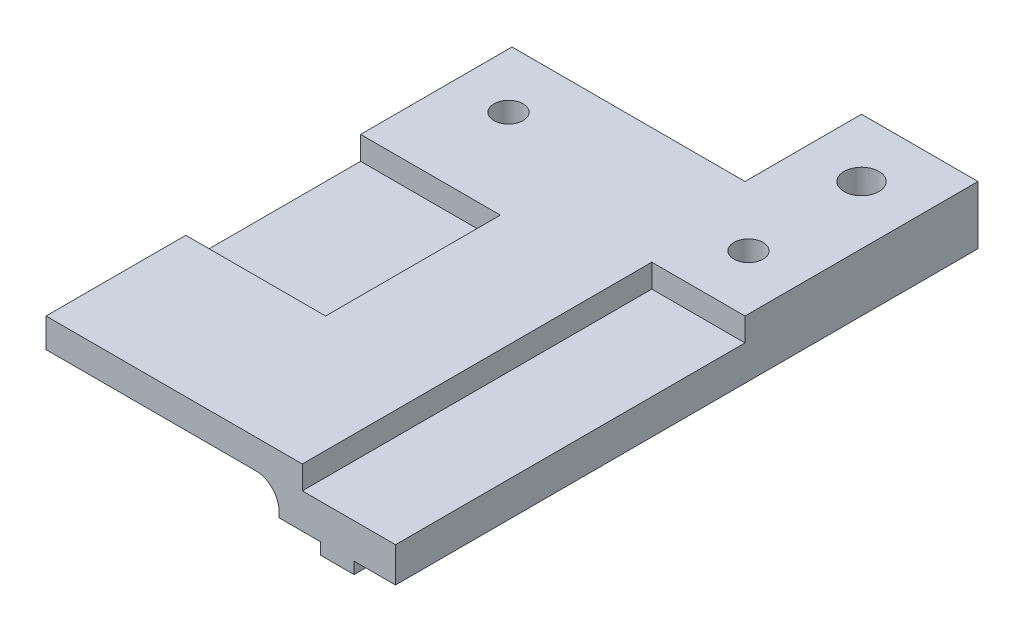
ISO-10303-21;
HEADER;
FILE_DESCRIPTION(('STEP AP214'),'2;1');
FILE_NAME('part.step','',(''),(''),'','','');
FILE_SCHEMA(('AUTOMOTIVE_DESIGN { 1 0 10303 214 1 1 1 1 }'));
ENDSEC;
DATA;
#1=APPLICATION_CONTEXT('core data for automotive mechanical design processes');
#2=APPLICATION_PROTOCOL_DEFINITION('international standard','automotive_design',2000,#1);
#3=PRODUCT_CONTEXT('',#1,'mechanical');
#4=PRODUCT('Part','Part','',(#3));
#5=PRODUCT_RELATED_PRODUCT_CATEGORY('part','',(#4));
#6=PRODUCT_DEFINITION_FORMATION('','',#4);
#7=PRODUCT_DEFINITION_CONTEXT('part definition',#1,'design');
#8=PRODUCT_DEFINITION('design','',#6,#7);
#9=PRODUCT_DEFINITION_SHAPE('','',#8);
#10=(LENGTH_UNIT() NAMED_UNIT(*) SI_UNIT(.MILLI.,.METRE.));
#11=(NAMED_UNIT(*) PLANE_ANGLE_UNIT() SI_UNIT($,.RADIAN.));
#12=(NAMED_UNIT(*) SI_UNIT($,.STERADIAN.) SOLID_ANGLE_UNIT());
#13=UNCERTAINTY_MEASURE_WITH_UNIT(LENGTH_MEASURE(1.E-05),#10,'distance_accuracy_value','');
#14=(GEOMETRIC_REPRESENTATION_CONTEXT(3) GLOBAL_UNCERTAINTY_ASSIGNED_CONTEXT((#13)) GLOBAL_UNIT_ASSIGNED_CONTEXT((#10,
#11,#12)) REPRESENTATION_CONTEXT('',''));
#15=CARTESIAN_POINT('',(0.,0.,0.));
#16=DIRECTION('',(0.,0.,1.));
#17=DIRECTION('',(1.,0.,0.));
#18=AXIS2_PLACEMENT_3D('',#15,#16,#17);
#19=CARTESIAN_POINT('',(8.55,-6.00000000000002,50.));
#20=DIRECTION('',(1.,0.,0.));
#21=DIRECTION('',(0.,0.,-1.));
#22=AXIS2_PLACEMENT_3D('',#19,#20,#21);
#23=PLANE('',#22);
#24=DIRECTION('',(0.,0.,-1.));
#25=VECTOR('',#24,1.);
#26=CARTESIAN_POINT('',(8.55,-5.00000000000001,50.));
#27=LINE('',#26,#25);
#28=CARTESIAN_POINT('',(8.55,-5.00000000000001,50.));
#29=VERTEX_POINT('',#28);
#30=CARTESIAN_POINT('',(8.55,-5.00000000000001,5.38405728739342));
#31=VERTEX_POINT('',#30);
#32=EDGE_CURVE('E374',#29,#31,#27,.T.);
#33=ORIENTED_EDGE('',*,*,#32,.T.);
#34=DIRECTION('',(0.,-1.,0.));
#35=VECTOR('',#34,1.);
#36=CARTESIAN_POINT('',(8.55,0.,5.38405728739338));
#37=LINE('',#36,#35);
#38=CARTESIAN_POINT('',(8.55,-6.00000000000002,5.38405728739343));
#39=VERTEX_POINT('',#38);
#40=EDGE_CURVE('E245',#31,#39,#37,.T.);
#41=ORIENTED_EDGE('',*,*,#40,.T.);
#42=DIRECTION('',(0.,0.,-1.));
#43=VECTOR('',#42,1.);
#44=CARTESIAN_POINT('',(8.55,-6.00000000000002,50.));
#45=LINE('',#44,#43);
#46=CARTESIAN_POINT('',(8.55,-6.00000000000002,50.));
#47=VERTEX_POINT('',#46);
#48=EDGE_CURVE('E370',#47,#39,#45,.T.);
#49=ORIENTED_EDGE('',*,*,#48,.F.);
#50=DIRECTION('',(0.,-1.,0.));
#51=VECTOR('',#50,1.);
#52=CARTESIAN_POINT('',(8.55,-6.00000000000002,50.));
#53=LINE('',#52,#51);
#54=EDGE_CURVE('E324',#29,#47,#53,.T.);
#55=ORIENTED_EDGE('',*,*,#54,.F.);
#56=EDGE_LOOP('',(#33,#41,#49,#55));
#57=FACE_BOUND('',#56,.T.);
#58=ADVANCED_FACE('F33',(#57),#23,.F.);
#59=CARTESIAN_POINT('',(11.45,-6.00000000000003,50.));
#60=DIRECTION('',(0.,1.,0.));
#61=DIRECTION('',(-1.,0.,0.));
#62=AXIS2_PLACEMENT_3D('',#59,#60,#61);
#63=PLANE('',#62);
#64=ORIENTED_EDGE('',*,*,#48,.T.);
#65=CARTESIAN_POINT('',(10.,-6.00000000000002,5.));
#66=DIRECTION('',(0.,-1.,0.));
#67=DIRECTION('',(1.,0.,0.));
#68=AXIS2_PLACEMENT_3D('',#65,#66,#67);
#69=CIRCLE('',#68,1.5);
#70=CARTESIAN_POINT('',(11.45,-6.00000000000003,5.38405728739343));
#71=VERTEX_POINT('',#70);
#72=EDGE_CURVE('E232',#71,#39,#69,.T.);
#73=ORIENTED_EDGE('',*,*,#72,.F.);
#74=DIRECTION('',(0.,0.,-1.));
#75=VECTOR('',#74,1.);
#76=CARTESIAN_POINT('',(11.45,-6.00000000000003,50.));
#77=LINE('',#76,#75);
#78=CARTESIAN_POINT('',(11.45,-6.00000000000003,14.5101020514434));
#79=VERTEX_POINT('',#78);
#80=EDGE_CURVE('E369',#79,#71,#77,.T.);
#81=ORIENTED_EDGE('',*,*,#80,.F.);
#82=CARTESIAN_POINT('',(10.3,-6.00000000000003,15.));
#83=DIRECTION('',(0.,1.,0.));
#84=DIRECTION('',(-1.,0.,0.));
#85=AXIS2_PLACEMENT_3D('',#82,#83,#84);
#86=CIRCLE('',#85,1.25);
#87=CARTESIAN_POINT('',(11.45,-6.00000000000003,15.4898979485566));
#88=VERTEX_POINT('',#87);
#89=EDGE_CURVE('E298',#79,#88,#86,.T.);
#90=ORIENTED_EDGE('',*,*,#89,.T.);
#91=CARTESIAN_POINT('',(11.45,-6.00000000000003,50.));
#92=VERTEX_POINT('',#91);
#93=EDGE_CURVE('E365',#92,#88,#77,.T.);
#94=ORIENTED_EDGE('',*,*,#93,.F.);
#95=DIRECTION('',(1.,0.,0.));
#96=VECTOR('',#95,1.);
#97=CARTESIAN_POINT('',(11.45,-6.00000000000003,50.));
#98=LINE('',#97,#96);
#99=EDGE_CURVE('E326',#47,#92,#98,.T.);
#100=ORIENTED_EDGE('',*,*,#99,.F.);
#101=EDGE_LOOP('',(#64,#73,#81,#90,#94,#100));
#102=FACE_BOUND('',#101,.T.);
#103=ADVANCED_FACE('F430',(#102),#63,.F.);
#104=CARTESIAN_POINT('',(11.45,-5.00000000000001,50.));
#105=DIRECTION('',(-1.,0.,0.));
#106=DIRECTION('',(0.,0.,1.));
#107=AXIS2_PLACEMENT_3D('',#104,#105,#106);
#108=PLANE('',#107);
#109=DIRECTION('',(0.,0.,-1.));
#110=VECTOR('',#109,1.);
#111=CARTESIAN_POINT('',(11.45,-5.00000000000001,50.));
#112=LINE('',#111,#110);
#113=CARTESIAN_POINT('',(11.45,-5.00000000000001,4.61594271260657));
#114=VERTEX_POINT('',#113);
#115=CARTESIAN_POINT('',(11.45,-5.00000000000001,0.));
#116=VERTEX_POINT('',#115);
#117=EDGE_CURVE('E359',#114,#116,#112,.T.);
#118=ORIENTED_EDGE('',*,*,#117,.F.);
#119=DIRECTION('',(0.,-1.,0.));
#120=VECTOR('',#119,1.);
#121=CARTESIAN_POINT('',(11.45,0.,4.61594271260653));
#122=LINE('',#121,#120);
#123=CARTESIAN_POINT('',(11.45,-6.00000000000003,4.61594271260657));
#124=VERTEX_POINT('',#123);
#125=EDGE_CURVE('E236',#114,#124,#122,.T.);
#126=ORIENTED_EDGE('',*,*,#125,.T.);
#127=CARTESIAN_POINT('',(11.45,-6.00000000000003,0.));
#128=VERTEX_POINT('',#127);
#129=EDGE_CURVE('E363',#124,#128,#77,.T.);
#130=ORIENTED_EDGE('',*,*,#129,.T.);
#131=DIRECTION('',(0.,1.,0.));
#132=VECTOR('',#131,1.);
#133=CARTESIAN_POINT('',(11.45,-5.00000000000001,0.));
#134=LINE('',#133,#132);
#135=EDGE_CURVE('E348',#128,#116,#134,.T.);
#136=ORIENTED_EDGE('',*,*,#135,.T.);
#137=EDGE_LOOP('',(#118,#126,#130,#136));
#138=FACE_BOUND('',#137,.T.);
#139=ADVANCED_FACE('F402',(#138),#108,.F.);
#140=ORIENTED_EDGE('',*,*,#93,.T.);
#141=DIRECTION('',(0.,1.,0.));
#142=VECTOR('',#141,1.);
#143=CARTESIAN_POINT('',(11.45,-6.00000000000003,15.4898979485566));
#144=LINE('',#143,#142);
#145=CARTESIAN_POINT('',(11.45,-5.00000000000001,15.4898979485566));
#146=VERTEX_POINT('',#145);
#147=EDGE_CURVE('E306',#88,#146,#144,.T.);
#148=ORIENTED_EDGE('',*,*,#147,.T.);
#149=CARTESIAN_POINT('',(11.45,-5.00000000000001,50.));
#150=VERTEX_POINT('',#149);
#151=EDGE_CURVE('E360',#150,#146,#112,.T.);
#152=ORIENTED_EDGE('',*,*,#151,.F.);
#153=DIRECTION('',(0.,1.,0.));
#154=VECTOR('',#153,1.);
#155=CARTESIAN_POINT('',(11.45,-5.00000000000001,50.));
#156=LINE('',#155,#154);
#157=EDGE_CURVE('E328',#92,#150,#156,.T.);
#158=ORIENTED_EDGE('',*,*,#157,.F.);
#159=EDGE_LOOP('',(#140,#148,#152,#158));
#160=FACE_BOUND('',#159,.T.);
#161=ADVANCED_FACE('F424',(#160),#108,.F.);
#162=CARTESIAN_POINT('',(15.,0.,50.));
#163=DIRECTION('',(0.,-1.,0.));
#164=DIRECTION('',(1.,0.,0.));
#165=AXIS2_PLACEMENT_3D('',#162,#163,#164);
#166=PLANE('',#165);
#167=CARTESIAN_POINT('',(10.,0.,5.));
#168=DIRECTION('',(0.,-1.,0.));
#169=DIRECTION('',(1.,0.,0.));
#170=AXIS2_PLACEMENT_3D('',#167,#168,#169);
#171=CIRCLE('',#170,1.5);
#172=CARTESIAN_POINT('',(11.5,0.,5.));
#173=VERTEX_POINT('',#172);
#174=EDGE_CURVE('E228',#173,#173,#171,.T.);
#175=ORIENTED_EDGE('',*,*,#174,.T.);
#176=EDGE_LOOP('',(#175));
#177=FACE_BOUND('',#176,.T.);
#178=CARTESIAN_POINT('',(10.3,0.,15.));
#179=DIRECTION('',(0.,1.,0.));
#180=DIRECTION('',(-1.,0.,0.));
#181=AXIS2_PLACEMENT_3D('',#178,#179,#180);
#182=CIRCLE('',#181,1.25);
#183=CARTESIAN_POINT('',(9.05,0.,15.));
#184=VERTEX_POINT('',#183);
#185=EDGE_CURVE('E293',#184,#184,#182,.T.);
#186=ORIENTED_EDGE('',*,*,#185,.F.);
#187=EDGE_LOOP('',(#186));
#188=FACE_BOUND('',#187,.T.);
#189=CARTESIAN_POINT('',(-10.3,0.,15.));
#190=DIRECTION('',(0.,1.,0.));
#191=DIRECTION('',(-1.,0.,0.));
#192=AXIS2_PLACEMENT_3D('',#189,#190,#191);
#193=CIRCLE('',#192,1.25);
#194=CARTESIAN_POINT('',(-11.55,0.,15.));
#195=VERTEX_POINT('',#194);
#196=EDGE_CURVE('E309',#195,#195,#193,.T.);
#197=ORIENTED_EDGE('',*,*,#196,.F.);
#198=EDGE_LOOP('',(#197));
#199=FACE_BOUND('',#198,.T.);
#200=DIRECTION('',(0.,0.,1.));
#201=VECTOR('',#200,1.);
#202=CARTESIAN_POINT('',(5.00000000000001,0.,10.));
#203=LINE('',#202,#201);
#204=CARTESIAN_POINT('',(5.00000000000001,0.,0.));
#205=VERTEX_POINT('',#204);
#206=CARTESIAN_POINT('',(5.00000000000001,0.,10.));
#207=VERTEX_POINT('',#206);
#208=EDGE_CURVE('E205',#205,#207,#203,.T.);
#209=ORIENTED_EDGE('',*,*,#208,.T.);
#210=DIRECTION('',(-1.,0.,0.));
#211=VECTOR('',#210,1.);
#212=CARTESIAN_POINT('',(-15.,0.,10.));
#213=LINE('',#212,#211);
#214=CARTESIAN_POINT('',(-15.,0.,10.));
#215=VERTEX_POINT('',#214);
#216=EDGE_CURVE('E210',#207,#215,#213,.T.);
#217=ORIENTED_EDGE('',*,*,#216,.T.);
#218=DIRECTION('',(0.,0.,-1.));
#219=VECTOR('',#218,1.);
#220=CARTESIAN_POINT('',(-15.,0.,50.));
#221=LINE('',#220,#219);
#222=CARTESIAN_POINT('',(-15.,0.,23.));
#223=VERTEX_POINT('',#222);
#224=EDGE_CURVE('E382',#223,#215,#221,.T.);
#225=ORIENTED_EDGE('',*,*,#224,.F.);
#226=DIRECTION('',(-1.,0.,0.));
#227=VECTOR('',#226,1.);
#228=CARTESIAN_POINT('',(-15.,0.,23.));
#229=LINE('',#228,#227);
#230=CARTESIAN_POINT('',(-3.,0.,23.));
#231=VERTEX_POINT('',#230);
#232=EDGE_CURVE('E253',#231,#223,#229,.T.);
#233=ORIENTED_EDGE('',*,*,#232,.F.);
#234=DIRECTION('',(0.,0.,-1.));
#235=VECTOR('',#234,1.);
#236=CARTESIAN_POINT('',(-3.,0.,23.));
#237=LINE('',#236,#235);
#238=CARTESIAN_POINT('',(-3.,0.,38.));
#239=VERTEX_POINT('',#238);
#240=EDGE_CURVE('E264',#239,#231,#237,.T.);
#241=ORIENTED_EDGE('',*,*,#240,.F.);
#242=DIRECTION('',(1.,0.,0.));
#243=VECTOR('',#242,1.);
#244=CARTESIAN_POINT('',(-15.,0.,38.));
#245=LINE('',#244,#243);
#246=CARTESIAN_POINT('',(-15.,0.,38.));
#247=VERTEX_POINT('',#246);
#248=EDGE_CURVE('E248',#247,#239,#245,.T.);
#249=ORIENTED_EDGE('',*,*,#248,.F.);
#250=CARTESIAN_POINT('',(-15.,0.,50.));
#251=VERTEX_POINT('',#250);
#252=EDGE_CURVE('E383',#251,#247,#221,.T.);
#253=ORIENTED_EDGE('',*,*,#252,.F.);
#254=DIRECTION('',(-1.,0.,0.));
#255=VECTOR('',#254,1.);
#256=CARTESIAN_POINT('',(15.,0.,50.));
#257=LINE('',#256,#255);
#258=CARTESIAN_POINT('',(7.,0.,50.));
#259=VERTEX_POINT('',#258);
#260=EDGE_CURVE('E313',#259,#251,#257,.T.);
#261=ORIENTED_EDGE('',*,*,#260,.F.);
#262=DIRECTION('',(0.,0.,1.));
#263=VECTOR('',#262,1.);
#264=CARTESIAN_POINT('',(7.,0.,20.));
#265=LINE('',#264,#263);
#266=CARTESIAN_POINT('',(7.,0.,20.));
#267=VERTEX_POINT('',#266);
#268=EDGE_CURVE('E271',#267,#259,#265,.T.);
#269=ORIENTED_EDGE('',*,*,#268,.F.);
#270=DIRECTION('',(-1.,0.,0.));
#271=VECTOR('',#270,1.);
#272=CARTESIAN_POINT('',(7.,0.,20.));
#273=LINE('',#272,#271);
#274=CARTESIAN_POINT('',(15.,0.,20.));
#275=VERTEX_POINT('',#274);
#276=EDGE_CURVE('E280',#275,#267,#273,.T.);
#277=ORIENTED_EDGE('',*,*,#276,.F.);
#278=DIRECTION('',(0.,0.,-1.));
#279=VECTOR('',#278,1.);
#280=CARTESIAN_POINT('',(15.,0.,50.));
#281=LINE('',#280,#279);
#282=CARTESIAN_POINT('',(15.,0.,0.));
#283=VERTEX_POINT('',#282);
#284=EDGE_CURVE('E335',#275,#283,#281,.T.);
#285=ORIENTED_EDGE('',*,*,#284,.T.);
#286=DIRECTION('',(-1.,0.,0.));
#287=VECTOR('',#286,1.);
#288=CARTESIAN_POINT('',(15.,0.,0.));
#289=LINE('',#288,#287);
#290=EDGE_CURVE('E221',#283,#205,#289,.T.);
#291=ORIENTED_EDGE('',*,*,#290,.T.);
#292=EDGE_LOOP('',(#209,#217,#225,#233,#241,#249,#253,#261,#269,#277,#285,#291));
#293=FACE_BOUND('',#292,.T.);
#294=ADVANCED_FACE('F219',(#177,#188,#199,#293),#166,.F.);
#295=CARTESIAN_POINT('',(-15.,-2.50000000000001,50.));
#296=DIRECTION('',(1.,0.,0.));
#297=DIRECTION('',(0.,0.,-1.));
#298=AXIS2_PLACEMENT_3D('',#295,#296,#297);
#299=PLANE('',#298);
#300=ORIENTED_EDGE('',*,*,#224,.T.);
#301=DIRECTION('',(0.,-1.,0.));
#302=VECTOR('',#301,1.);
#303=CARTESIAN_POINT('',(-15.,0.,10.));
#304=LINE('',#303,#302);
#305=CARTESIAN_POINT('',(-15.,-2.50000000000001,10.));
#306=VERTEX_POINT('',#305);
#307=EDGE_CURVE('E209',#215,#306,#304,.T.);
#308=ORIENTED_EDGE('',*,*,#307,.T.);
#309=DIRECTION('',(0.,0.,-1.));
#310=VECTOR('',#309,1.);
#311=CARTESIAN_POINT('',(-15.,-2.50000000000001,50.));
#312=LINE('',#311,#310);
#313=CARTESIAN_POINT('',(-15.,-2.50000000000001,50.));
#314=VERTEX_POINT('',#313);
#315=EDGE_CURVE('E379',#314,#306,#312,.T.);
#316=ORIENTED_EDGE('',*,*,#315,.F.);
#317=DIRECTION('',(0.,-1.,0.));
#318=VECTOR('',#317,1.);
#319=CARTESIAN_POINT('',(-15.,-2.50000000000001,50.));
#320=LINE('',#319,#318);
#321=EDGE_CURVE('E315',#251,#314,#320,.T.);
#322=ORIENTED_EDGE('',*,*,#321,.F.);
#323=ORIENTED_EDGE('',*,*,#252,.T.);
#324=DIRECTION('',(0.,1.,0.));
#325=VECTOR('',#324,1.);
#326=CARTESIAN_POINT('',(-15.,-2.,38.));
#327=LINE('',#326,#325);
#328=CARTESIAN_POINT('',(-15.,-2.,38.));
#329=VERTEX_POINT('',#328);
#330=EDGE_CURVE('E261',#329,#247,#327,.T.);
#331=ORIENTED_EDGE('',*,*,#330,.F.);
#332=DIRECTION('',(0.,0.,1.));
#333=VECTOR('',#332,1.);
#334=CARTESIAN_POINT('',(-15.,-2.,23.));
#335=LINE('',#334,#333);
#336=CARTESIAN_POINT('',(-15.,-2.,23.));
#337=VERTEX_POINT('',#336);
#338=EDGE_CURVE('E249',#337,#329,#335,.T.);
#339=ORIENTED_EDGE('',*,*,#338,.F.);
#340=DIRECTION('',(0.,1.,0.));
#341=VECTOR('',#340,1.);
#342=CARTESIAN_POINT('',(-15.,-2.,23.));
#343=LINE('',#342,#341);
#344=EDGE_CURVE('E268',#337,#223,#343,.T.);
#345=ORIENTED_EDGE('',*,*,#344,.T.);
#346=EDGE_LOOP('',(#300,#308,#316,#322,#323,#331,#339,#345));
#347=FACE_BOUND('',#346,.T.);
#348=ADVANCED_FACE('F460',(#347),#299,.F.);
#349=CARTESIAN_POINT('',(5.,-2.50000000000001,50.));
#350=DIRECTION('',(0.,1.,0.));
#351=DIRECTION('',(-1.,0.,0.));
#352=AXIS2_PLACEMENT_3D('',#349,#350,#351);
#353=PLANE('',#352);
#354=CARTESIAN_POINT('',(-10.3,-2.50000000000001,15.));
#355=DIRECTION('',(0.,1.,0.));
#356=DIRECTION('',(-1.,0.,0.));
#357=AXIS2_PLACEMENT_3D('',#354,#355,#356);
#358=CIRCLE('',#357,1.25);
#359=CARTESIAN_POINT('',(-11.55,-2.50000000000001,15.));
#360=VERTEX_POINT('',#359);
#361=EDGE_CURVE('E312',#360,#360,#358,.T.);
#362=ORIENTED_EDGE('',*,*,#361,.T.);
#363=EDGE_LOOP('',(#362));
#364=FACE_BOUND('',#363,.T.);
#365=DIRECTION('',(1.,0.,0.));
#366=VECTOR('',#365,1.);
#367=CARTESIAN_POINT('',(5.,-2.50000000000001,10.));
#368=LINE('',#367,#366);
#369=CARTESIAN_POINT('',(3.,-2.50000000000001,10.));
#370=VERTEX_POINT('',#369);
#371=EDGE_CURVE('E224',#306,#370,#368,.T.);
#372=ORIENTED_EDGE('',*,*,#371,.T.);
#373=DIRECTION('',(0.,0.,-1.));
#374=VECTOR('',#373,1.);
#375=CARTESIAN_POINT('',(3.,-2.50000000000001,50.));
#376=LINE('',#375,#374);
#377=CARTESIAN_POINT('',(3.,-2.50000000000001,50.));
#378=VERTEX_POINT('',#377);
#379=EDGE_CURVE('E48',#370,#378,#376,.F.);
#380=ORIENTED_EDGE('',*,*,#379,.T.);
#381=DIRECTION('',(1.,0.,0.));
#382=VECTOR('',#381,1.);
#383=CARTESIAN_POINT('',(5.,-2.50000000000001,50.));
#384=LINE('',#383,#382);
#385=EDGE_CURVE('E318',#314,#378,#384,.T.);
#386=ORIENTED_EDGE('',*,*,#385,.F.);
#387=ORIENTED_EDGE('',*,*,#315,.T.);
#388=EDGE_LOOP('',(#372,#380,#386,#387));
#389=FACE_BOUND('',#388,.T.);
#390=ADVANCED_FACE('F458',(#364,#389),#353,.F.);
#391=CARTESIAN_POINT('',(5.,-5.00000000000001,50.));
#392=DIRECTION('',(1.,0.,0.));
#393=DIRECTION('',(0.,0.,-1.));
#394=AXIS2_PLACEMENT_3D('',#391,#392,#393);
#395=PLANE('',#394);
#396=DIRECTION('',(0.,-1.,0.));
#397=VECTOR('',#396,1.);
#398=CARTESIAN_POINT('',(5.,-5.00000000000001,50.));
#399=LINE('',#398,#397);
#400=CARTESIAN_POINT('',(5.,-4.50000000000001,50.));
#401=VERTEX_POINT('',#400);
#402=CARTESIAN_POINT('',(5.,-5.00000000000001,50.));
#403=VERTEX_POINT('',#402);
#404=EDGE_CURVE('E320',#401,#403,#399,.T.);
#405=ORIENTED_EDGE('',*,*,#404,.F.);
#406=DIRECTION('',(0.,0.,-1.));
#407=VECTOR('',#406,1.);
#408=CARTESIAN_POINT('',(5.,-4.50000000000001,10.));
#409=LINE('',#408,#407);
#410=CARTESIAN_POINT('',(5.,-4.50000000000001,10.));
#411=VERTEX_POINT('',#410);
#412=EDGE_CURVE('E208',#401,#411,#409,.T.);
#413=ORIENTED_EDGE('',*,*,#412,.T.);
#414=DIRECTION('',(0.,-1.,0.));
#415=VECTOR('',#414,1.);
#416=CARTESIAN_POINT('',(5.00000000000001,0.,10.));
#417=LINE('',#416,#415);
#418=EDGE_CURVE('E199',#207,#411,#417,.T.);
#419=ORIENTED_EDGE('',*,*,#418,.F.);
#420=ORIENTED_EDGE('',*,*,#208,.F.);
#421=DIRECTION('',(0.,-1.,0.));
#422=VECTOR('',#421,1.);
#423=CARTESIAN_POINT('',(5.,-5.00000000000001,0.));
#424=LINE('',#423,#422);
#425=CARTESIAN_POINT('',(5.,-5.00000000000001,0.));
#426=VERTEX_POINT('',#425);
#427=EDGE_CURVE('E337',#205,#426,#424,.T.);
#428=ORIENTED_EDGE('',*,*,#427,.T.);
#429=DIRECTION('',(0.,0.,-1.));
#430=VECTOR('',#429,1.);
#431=CARTESIAN_POINT('',(5.,-5.00000000000001,50.));
#432=LINE('',#431,#430);
#433=EDGE_CURVE('E377',#403,#426,#432,.T.);
#434=ORIENTED_EDGE('',*,*,#433,.F.);
#435=EDGE_LOOP('',(#405,#413,#419,#420,#428,#434));
#436=FACE_BOUND('',#435,.T.);
#437=ADVANCED_FACE('F202',(#436),#395,.F.);
#438=CARTESIAN_POINT('',(8.55,-5.00000000000001,50.));
#439=DIRECTION('',(0.,1.,0.));
#440=DIRECTION('',(0.,0.,1.));
#441=AXIS2_PLACEMENT_3D('',#438,#439,#440);
#442=PLANE('',#441);
#443=CARTESIAN_POINT('',(8.54999999999999,-5.00000000000001,4.61594271260662));
#444=VERTEX_POINT('',#443);
#445=CARTESIAN_POINT('',(8.55,-5.00000000000001,0.));
#446=VERTEX_POINT('',#445);
#447=EDGE_CURVE('E373',#444,#446,#27,.T.);
#448=ORIENTED_EDGE('',*,*,#447,.F.);
#449=CARTESIAN_POINT('',(10.,-5.00000000000001,5.));
#450=DIRECTION('',(0.,1.,0.));
#451=DIRECTION('',(0.,0.,1.));
#452=AXIS2_PLACEMENT_3D('',#449,#450,#451);
#453=CIRCLE('',#452,1.5);
#454=EDGE_CURVE('E242',#444,#31,#453,.T.);
#455=ORIENTED_EDGE('',*,*,#454,.T.);
#456=ORIENTED_EDGE('',*,*,#32,.F.);
#457=DIRECTION('',(1.,0.,0.));
#458=VECTOR('',#457,1.);
#459=CARTESIAN_POINT('',(8.55,-5.00000000000001,50.));
#460=LINE('',#459,#458);
#461=EDGE_CURVE('E322',#403,#29,#460,.T.);
#462=ORIENTED_EDGE('',*,*,#461,.F.);
#463=ORIENTED_EDGE('',*,*,#433,.T.);
#464=DIRECTION('',(1.,0.,0.));
#465=VECTOR('',#464,1.);
#466=CARTESIAN_POINT('',(8.55,-5.00000000000001,0.));
#467=LINE('',#466,#465);
#468=EDGE_CURVE('E339',#426,#446,#467,.T.);
#469=ORIENTED_EDGE('',*,*,#468,.T.);
#470=EDGE_LOOP('',(#448,#455,#456,#462,#463,#469));
#471=FACE_BOUND('',#470,.T.);
#472=ADVANCED_FACE('F445',(#471),#442,.F.);
#473=CARTESIAN_POINT('',(8.55,-6.00000000000002,4.61594271260657));
#474=VERTEX_POINT('',#473);
#475=CARTESIAN_POINT('',(8.55,-6.00000000000002,0.));
#476=VERTEX_POINT('',#475);
#477=EDGE_CURVE('E368',#474,#476,#45,.T.);
#478=ORIENTED_EDGE('',*,*,#477,.F.);
#479=DIRECTION('',(0.,-1.,0.));
#480=VECTOR('',#479,1.);
#481=CARTESIAN_POINT('',(8.55,0.,4.61594271260662));
#482=LINE('',#481,#480);
#483=EDGE_CURVE('E239',#474,#444,#482,.F.);
#484=ORIENTED_EDGE('',*,*,#483,.T.);
#485=ORIENTED_EDGE('',*,*,#447,.T.);
#486=DIRECTION('',(0.,-1.,0.));
#487=VECTOR('',#486,1.);
#488=CARTESIAN_POINT('',(8.55,-6.00000000000002,0.));
#489=LINE('',#488,#487);
#490=EDGE_CURVE('E342',#446,#476,#489,.T.);
#491=ORIENTED_EDGE('',*,*,#490,.T.);
#492=EDGE_LOOP('',(#478,#484,#485,#491));
#493=FACE_BOUND('',#492,.T.);
#494=ADVANCED_FACE('F449',(#493),#23,.F.);
#495=ORIENTED_EDGE('',*,*,#129,.F.);
#496=EDGE_CURVE('E227',#474,#124,#69,.T.);
#497=ORIENTED_EDGE('',*,*,#496,.F.);
#498=ORIENTED_EDGE('',*,*,#477,.T.);
#499=DIRECTION('',(1.,0.,0.));
#500=VECTOR('',#499,1.);
#501=CARTESIAN_POINT('',(11.45,-6.00000000000003,0.));
#502=LINE('',#501,#500);
#503=EDGE_CURVE('E345',#476,#128,#502,.T.);
#504=ORIENTED_EDGE('',*,*,#503,.T.);
#505=EDGE_LOOP('',(#495,#497,#498,#504));
#506=FACE_BOUND('',#505,.T.);
#507=ADVANCED_FACE('F452',(#506),#63,.F.);
#508=ORIENTED_EDGE('',*,*,#80,.T.);
#509=DIRECTION('',(0.,-1.,0.));
#510=VECTOR('',#509,1.);
#511=CARTESIAN_POINT('',(11.45,0.,5.38405728739347));
#512=LINE('',#511,#510);
#513=CARTESIAN_POINT('',(11.45,-5.00000000000001,5.38405728739343));
#514=VERTEX_POINT('',#513);
#515=EDGE_CURVE('E231',#71,#514,#512,.F.);
#516=ORIENTED_EDGE('',*,*,#515,.T.);
#517=CARTESIAN_POINT('',(11.45,-5.00000000000001,14.5101020514434));
#518=VERTEX_POINT('',#517);
#519=EDGE_CURVE('E364',#518,#514,#112,.T.);
#520=ORIENTED_EDGE('',*,*,#519,.F.);
#521=DIRECTION('',(0.,1.,0.));
#522=VECTOR('',#521,1.);
#523=CARTESIAN_POINT('',(11.45,-6.00000000000003,14.5101020514434));
#524=LINE('',#523,#522);
#525=EDGE_CURVE('E301',#518,#79,#524,.F.);
#526=ORIENTED_EDGE('',*,*,#525,.T.);
#527=EDGE_LOOP('',(#508,#516,#520,#526));
#528=FACE_BOUND('',#527,.T.);
#529=ADVANCED_FACE('F435',(#528),#108,.F.);
#530=CARTESIAN_POINT('',(15.,-5.00000000000001,50.));
#531=DIRECTION('',(0.,1.,0.));
#532=DIRECTION('',(0.,0.,1.));
#533=AXIS2_PLACEMENT_3D('',#530,#531,#532);
#534=PLANE('',#533);
#535=ORIENTED_EDGE('',*,*,#519,.T.);
#536=CARTESIAN_POINT('',(10.,-5.00000000000001,5.));
#537=DIRECTION('',(0.,1.,0.));
#538=DIRECTION('',(0.,0.,1.));
#539=AXIS2_PLACEMENT_3D('',#536,#537,#538);
#540=CIRCLE('',#539,1.5);
#541=EDGE_CURVE('E391',#514,#114,#540,.T.);
#542=ORIENTED_EDGE('',*,*,#541,.T.);
#543=ORIENTED_EDGE('',*,*,#117,.T.);
#544=DIRECTION('',(1.,0.,0.));
#545=VECTOR('',#544,1.);
#546=CARTESIAN_POINT('',(15.,-5.00000000000001,0.));
#547=LINE('',#546,#545);
#548=CARTESIAN_POINT('',(15.,-5.00000000000001,0.));
#549=VERTEX_POINT('',#548);
#550=EDGE_CURVE('E351',#116,#549,#547,.T.);
#551=ORIENTED_EDGE('',*,*,#550,.T.);
#552=DIRECTION('',(0.,0.,-1.));
#553=VECTOR('',#552,1.);
#554=CARTESIAN_POINT('',(15.,-5.00000000000001,50.));
#555=LINE('',#554,#553);
#556=CARTESIAN_POINT('',(15.,-5.00000000000001,50.));
#557=VERTEX_POINT('',#556);
#558=EDGE_CURVE('E356',#557,#549,#555,.T.);
#559=ORIENTED_EDGE('',*,*,#558,.F.);
#560=DIRECTION('',(1.,0.,0.));
#561=VECTOR('',#560,1.);
#562=CARTESIAN_POINT('',(15.,-5.00000000000001,50.));
#563=LINE('',#562,#561);
#564=EDGE_CURVE('E330',#150,#557,#563,.T.);
#565=ORIENTED_EDGE('',*,*,#564,.F.);
#566=ORIENTED_EDGE('',*,*,#151,.T.);
#567=CARTESIAN_POINT('',(10.3,-5.00000000000001,15.));
#568=DIRECTION('',(0.,1.,0.));
#569=DIRECTION('',(0.,0.,1.));
#570=AXIS2_PLACEMENT_3D('',#567,#568,#569);
#571=CIRCLE('',#570,1.25);
#572=EDGE_CURVE('E386',#146,#518,#571,.T.);
#573=ORIENTED_EDGE('',*,*,#572,.T.);
#574=EDGE_LOOP('',(#535,#542,#543,#551,#559,#565,#566,#573));
#575=FACE_BOUND('',#574,.T.);
#576=ADVANCED_FACE('F398',(#575),#534,.F.);
#577=CARTESIAN_POINT('',(15.,0.,50.));
#578=DIRECTION('',(-1.,0.,0.));
#579=DIRECTION('',(0.,-1.,0.));
#580=AXIS2_PLACEMENT_3D('',#577,#578,#579);
#581=PLANE('',#580);
#582=ORIENTED_EDGE('',*,*,#284,.F.);
#583=DIRECTION('',(0.,1.,0.));
#584=VECTOR('',#583,1.);
#585=CARTESIAN_POINT('',(15.,-2.,20.));
#586=LINE('',#585,#584);
#587=CARTESIAN_POINT('',(15.,-2.,20.));
#588=VERTEX_POINT('',#587);
#589=EDGE_CURVE('E294',#588,#275,#586,.T.);
#590=ORIENTED_EDGE('',*,*,#589,.F.);
#591=DIRECTION('',(0.,0.,-1.));
#592=VECTOR('',#591,1.);
#593=CARTESIAN_POINT('',(15.,-2.,20.));
#594=LINE('',#593,#592);
#595=CARTESIAN_POINT('',(15.,-2.,50.));
#596=VERTEX_POINT('',#595);
#597=EDGE_CURVE('E282',#596,#588,#594,.T.);
#598=ORIENTED_EDGE('',*,*,#597,.F.);
#599=DIRECTION('',(0.,1.,0.));
#600=VECTOR('',#599,1.);
#601=CARTESIAN_POINT('',(15.,0.,50.));
#602=LINE('',#601,#600);
#603=EDGE_CURVE('E332',#557,#596,#602,.T.);
#604=ORIENTED_EDGE('',*,*,#603,.F.);
#605=ORIENTED_EDGE('',*,*,#558,.T.);
#606=DIRECTION('',(0.,1.,0.));
#607=VECTOR('',#606,1.);
#608=CARTESIAN_POINT('',(15.,0.,0.));
#609=LINE('',#608,#607);
#610=EDGE_CURVE('E316',#549,#283,#609,.T.);
#611=ORIENTED_EDGE('',*,*,#610,.T.);
#612=EDGE_LOOP('',(#582,#590,#598,#604,#605,#611));
#613=FACE_BOUND('',#612,.T.);
#614=ADVANCED_FACE('F415',(#613),#581,.F.);
#615=CARTESIAN_POINT('',(0.,0.,50.));
#616=DIRECTION('',(0.,0.,-1.));
#617=DIRECTION('',(-1.,0.,0.));
#618=AXIS2_PLACEMENT_3D('',#615,#616,#617);
#619=PLANE('',#618);
#620=DIRECTION('',(1.,0.,0.));
#621=VECTOR('',#620,1.);
#622=CARTESIAN_POINT('',(7.,-2.,50.));
#623=LINE('',#622,#621);
#624=CARTESIAN_POINT('',(7.,-2.,50.));
#625=VERTEX_POINT('',#624);
#626=EDGE_CURVE('E279',#625,#596,#623,.T.);
#627=ORIENTED_EDGE('',*,*,#626,.F.);
#628=DIRECTION('',(0.,1.,0.));
#629=VECTOR('',#628,1.);
#630=CARTESIAN_POINT('',(7.,-2.,50.));
#631=LINE('',#630,#629);
#632=EDGE_CURVE('E287',#625,#259,#631,.T.);
#633=ORIENTED_EDGE('',*,*,#632,.T.);
#634=ORIENTED_EDGE('',*,*,#260,.T.);
#635=ORIENTED_EDGE('',*,*,#321,.T.);
#636=ORIENTED_EDGE('',*,*,#385,.T.);
#637=CARTESIAN_POINT('',(3.,-4.50000000000001,50.));
#638=DIRECTION('',(0.,0.,-1.));
#639=DIRECTION('',(-1.,0.,0.));
#640=AXIS2_PLACEMENT_3D('',#637,#638,#639);
#641=CIRCLE('',#640,2.);
#642=EDGE_CURVE('E11',#378,#401,#641,.T.);
#643=ORIENTED_EDGE('',*,*,#642,.T.);
#644=ORIENTED_EDGE('',*,*,#404,.T.);
#645=ORIENTED_EDGE('',*,*,#461,.T.);
#646=ORIENTED_EDGE('',*,*,#54,.T.);
#647=ORIENTED_EDGE('',*,*,#99,.T.);
#648=ORIENTED_EDGE('',*,*,#157,.T.);
#649=ORIENTED_EDGE('',*,*,#564,.T.);
#650=ORIENTED_EDGE('',*,*,#603,.T.);
#651=EDGE_LOOP('',(#627,#633,#634,#635,#636,#643,#644,#645,#646,#647,#648,#649,#650));
#652=FACE_BOUND('',#651,.T.);
#653=ADVANCED_FACE('F420',(#652),#619,.F.);
#654=CARTESIAN_POINT('',(0.,0.,0.));
#655=DIRECTION('',(0.,0.,-1.));
#656=DIRECTION('',(-1.,0.,0.));
#657=AXIS2_PLACEMENT_3D('',#654,#655,#656);
#658=PLANE('',#657);
#659=ORIENTED_EDGE('',*,*,#427,.F.);
#660=ORIENTED_EDGE('',*,*,#290,.F.);
#661=ORIENTED_EDGE('',*,*,#610,.F.);
#662=ORIENTED_EDGE('',*,*,#550,.F.);
#663=ORIENTED_EDGE('',*,*,#135,.F.);
#664=ORIENTED_EDGE('',*,*,#503,.F.);
#665=ORIENTED_EDGE('',*,*,#490,.F.);
#666=ORIENTED_EDGE('',*,*,#468,.F.);
#667=EDGE_LOOP('',(#659,#660,#661,#662,#663,#664,#665,#666));
#668=FACE_BOUND('',#667,.T.);
#669=ADVANCED_FACE('F409',(#668),#658,.T.);
#670=CARTESIAN_POINT('',(-10.3,-6.00000000000003,15.));
#671=DIRECTION('',(0.,1.,0.));
#672=DIRECTION('',(-1.,0.,0.));
#673=AXIS2_PLACEMENT_3D('',#670,#671,#672);
#674=CYLINDRICAL_SURFACE('',#673,1.25);
#675=ORIENTED_EDGE('',*,*,#196,.T.);
#676=EDGE_LOOP('',(#675));
#677=FACE_BOUND('',#676,.T.);
#678=ORIENTED_EDGE('',*,*,#361,.F.);
#679=EDGE_LOOP('',(#678));
#680=FACE_BOUND('',#679,.T.);
#681=ADVANCED_FACE('F523',(#677,#680),#674,.F.);
#682=CARTESIAN_POINT('',(10.3,-6.00000000000003,15.));
#683=DIRECTION('',(0.,1.,0.));
#684=DIRECTION('',(-1.,0.,0.));
#685=AXIS2_PLACEMENT_3D('',#682,#683,#684);
#686=CYLINDRICAL_SURFACE('',#685,1.25);
#687=ORIENTED_EDGE('',*,*,#185,.T.);
#688=EDGE_LOOP('',(#687));
#689=FACE_BOUND('',#688,.T.);
#690=ORIENTED_EDGE('',*,*,#89,.F.);
#691=ORIENTED_EDGE('',*,*,#525,.F.);
#692=ORIENTED_EDGE('',*,*,#572,.F.);
#693=ORIENTED_EDGE('',*,*,#147,.F.);
#694=EDGE_LOOP('',(#690,#691,#692,#693));
#695=FACE_BOUND('',#694,.T.);
#696=ADVANCED_FACE('F427',(#689,#695),#686,.F.);
#697=CARTESIAN_POINT('',(7.,-2.,20.));
#698=DIRECTION('',(-1.,0.,0.));
#699=DIRECTION('',(0.,-1.,0.));
#700=AXIS2_PLACEMENT_3D('',#697,#698,#699);
#701=PLANE('',#700);
#702=ORIENTED_EDGE('',*,*,#268,.T.);
#703=ORIENTED_EDGE('',*,*,#632,.F.);
#704=DIRECTION('',(0.,0.,1.));
#705=VECTOR('',#704,1.);
#706=CARTESIAN_POINT('',(7.,-2.,20.));
#707=LINE('',#706,#705);
#708=CARTESIAN_POINT('',(7.,-2.,20.));
#709=VERTEX_POINT('',#708);
#710=EDGE_CURVE('E277',#709,#625,#707,.T.);
#711=ORIENTED_EDGE('',*,*,#710,.F.);
#712=DIRECTION('',(0.,1.,0.));
#713=VECTOR('',#712,1.);
#714=CARTESIAN_POINT('',(7.,-2.,20.));
#715=LINE('',#714,#713);
#716=EDGE_CURVE('E291',#709,#267,#715,.T.);
#717=ORIENTED_EDGE('',*,*,#716,.T.);
#718=EDGE_LOOP('',(#702,#703,#711,#717));
#719=FACE_BOUND('',#718,.T.);
#720=ADVANCED_FACE('F532',(#719),#701,.F.);
#721=CARTESIAN_POINT('',(7.,-2.,20.));
#722=DIRECTION('',(0.,0.,-1.));
#723=DIRECTION('',(-1.,0.,0.));
#724=AXIS2_PLACEMENT_3D('',#721,#722,#723);
#725=PLANE('',#724);
#726=ORIENTED_EDGE('',*,*,#276,.T.);
#727=ORIENTED_EDGE('',*,*,#716,.F.);
#728=DIRECTION('',(-1.,0.,0.));
#729=VECTOR('',#728,1.);
#730=CARTESIAN_POINT('',(7.,-2.,20.));
#731=LINE('',#730,#729);
#732=EDGE_CURVE('E284',#588,#709,#731,.T.);
#733=ORIENTED_EDGE('',*,*,#732,.F.);
#734=ORIENTED_EDGE('',*,*,#589,.T.);
#735=EDGE_LOOP('',(#726,#727,#733,#734));
#736=FACE_BOUND('',#735,.T.);
#737=ADVANCED_FACE('F584',(#736),#725,.F.);
#738=CARTESIAN_POINT('',(0.,-2.,0.));
#739=DIRECTION('',(0.,1.,0.));
#740=DIRECTION('',(-1.,0.,0.));
#741=AXIS2_PLACEMENT_3D('',#738,#739,#740);
#742=PLANE('',#741);
#743=ORIENTED_EDGE('',*,*,#710,.T.);
#744=ORIENTED_EDGE('',*,*,#626,.T.);
#745=ORIENTED_EDGE('',*,*,#597,.T.);
#746=ORIENTED_EDGE('',*,*,#732,.T.);
#747=EDGE_LOOP('',(#743,#744,#745,#746));
#748=FACE_BOUND('',#747,.T.);
#749=ADVANCED_FACE('F593',(#748),#742,.T.);
#750=CARTESIAN_POINT('',(-15.,-2.,23.));
#751=DIRECTION('',(0.,0.,-1.));
#752=DIRECTION('',(-1.,0.,0.));
#753=AXIS2_PLACEMENT_3D('',#750,#751,#752);
#754=PLANE('',#753);
#755=ORIENTED_EDGE('',*,*,#232,.T.);
#756=ORIENTED_EDGE('',*,*,#344,.F.);
#757=DIRECTION('',(-1.,0.,0.));
#758=VECTOR('',#757,1.);
#759=CARTESIAN_POINT('',(-15.,-2.,23.));
#760=LINE('',#759,#758);
#761=CARTESIAN_POINT('',(-3.,-2.,23.));
#762=VERTEX_POINT('',#761);
#763=EDGE_CURVE('E259',#762,#337,#760,.T.);
#764=ORIENTED_EDGE('',*,*,#763,.F.);
#765=DIRECTION('',(0.,1.,0.));
#766=VECTOR('',#765,1.);
#767=CARTESIAN_POINT('',(-3.,-2.,23.));
#768=LINE('',#767,#766);
#769=EDGE_CURVE('E272',#762,#231,#768,.T.);
#770=ORIENTED_EDGE('',*,*,#769,.T.);
#771=EDGE_LOOP('',(#755,#756,#764,#770));
#772=FACE_BOUND('',#771,.T.);
#773=ADVANCED_FACE('F468',(#772),#754,.F.);
#774=CARTESIAN_POINT('',(-3.,-2.,23.));
#775=DIRECTION('',(1.,0.,0.));
#776=DIRECTION('',(0.,1.,0.));
#777=AXIS2_PLACEMENT_3D('',#774,#775,#776);
#778=PLANE('',#777);
#779=ORIENTED_EDGE('',*,*,#240,.T.);
#780=ORIENTED_EDGE('',*,*,#769,.F.);
#781=DIRECTION('',(0.,0.,-1.));
#782=VECTOR('',#781,1.);
#783=CARTESIAN_POINT('',(-3.,-2.,23.));
#784=LINE('',#783,#782);
#785=CARTESIAN_POINT('',(-3.,-2.,38.));
#786=VERTEX_POINT('',#785);
#787=EDGE_CURVE('E256',#786,#762,#784,.T.);
#788=ORIENTED_EDGE('',*,*,#787,.F.);
#789=DIRECTION('',(0.,1.,0.));
#790=VECTOR('',#789,1.);
#791=CARTESIAN_POINT('',(-3.,-2.,38.));
#792=LINE('',#791,#790);
#793=EDGE_CURVE('E274',#786,#239,#792,.T.);
#794=ORIENTED_EDGE('',*,*,#793,.T.);
#795=EDGE_LOOP('',(#779,#780,#788,#794));
#796=FACE_BOUND('',#795,.T.);
#797=ADVANCED_FACE('F472',(#796),#778,.F.);
#798=CARTESIAN_POINT('',(-15.,-2.,38.));
#799=DIRECTION('',(0.,0.,1.));
#800=DIRECTION('',(1.,0.,0.));
#801=AXIS2_PLACEMENT_3D('',#798,#799,#800);
#802=PLANE('',#801);
#803=ORIENTED_EDGE('',*,*,#248,.T.);
#804=ORIENTED_EDGE('',*,*,#793,.F.);
#805=DIRECTION('',(1.,0.,0.));
#806=VECTOR('',#805,1.);
#807=CARTESIAN_POINT('',(-15.,-2.,38.));
#808=LINE('',#807,#806);
#809=EDGE_CURVE('E252',#329,#786,#808,.T.);
#810=ORIENTED_EDGE('',*,*,#809,.F.);
#811=ORIENTED_EDGE('',*,*,#330,.T.);
#812=EDGE_LOOP('',(#803,#804,#810,#811));
#813=FACE_BOUND('',#812,.T.);
#814=ADVANCED_FACE('F474',(#813),#802,.F.);
#815=CARTESIAN_POINT('',(0.,-2.,0.));
#816=DIRECTION('',(0.,1.,0.));
#817=DIRECTION('',(-1.,0.,0.));
#818=AXIS2_PLACEMENT_3D('',#815,#816,#817);
#819=PLANE('',#818);
#820=ORIENTED_EDGE('',*,*,#338,.T.);
#821=ORIENTED_EDGE('',*,*,#809,.T.);
#822=ORIENTED_EDGE('',*,*,#787,.T.);
#823=ORIENTED_EDGE('',*,*,#763,.T.);
#824=EDGE_LOOP('',(#820,#821,#822,#823));
#825=FACE_BOUND('',#824,.T.);
#826=ADVANCED_FACE('F478',(#825),#819,.T.);
#827=CARTESIAN_POINT('',(10.,0.,5.));
#828=DIRECTION('',(0.,-1.,0.));
#829=DIRECTION('',(1.,0.,0.));
#830=AXIS2_PLACEMENT_3D('',#827,#828,#829);
#831=CYLINDRICAL_SURFACE('',#830,1.5);
#832=ORIENTED_EDGE('',*,*,#174,.F.);
#833=EDGE_LOOP('',(#832));
#834=FACE_BOUND('',#833,.T.);
#835=ORIENTED_EDGE('',*,*,#454,.F.);
#836=ORIENTED_EDGE('',*,*,#483,.F.);
#837=ORIENTED_EDGE('',*,*,#496,.T.);
#838=ORIENTED_EDGE('',*,*,#125,.F.);
#839=ORIENTED_EDGE('',*,*,#541,.F.);
#840=ORIENTED_EDGE('',*,*,#515,.F.);
#841=ORIENTED_EDGE('',*,*,#72,.T.);
#842=ORIENTED_EDGE('',*,*,#40,.F.);
#843=EDGE_LOOP('',(#835,#836,#837,#838,#839,#840,#841,#842));
#844=FACE_BOUND('',#843,.T.);
#845=ADVANCED_FACE('F436',(#834,#844),#831,.F.);
#846=CARTESIAN_POINT('',(-15.,0.,10.));
#847=DIRECTION('',(0.,0.,1.));
#848=DIRECTION('',(1.,0.,0.));
#849=AXIS2_PLACEMENT_3D('',#846,#847,#848);
#850=PLANE('',#849);
#851=ORIENTED_EDGE('',*,*,#307,.F.);
#852=ORIENTED_EDGE('',*,*,#216,.F.);
#853=ORIENTED_EDGE('',*,*,#418,.T.);
#854=CARTESIAN_POINT('',(3.,-4.50000000000001,10.));
#855=DIRECTION('',(0.,0.,1.));
#856=DIRECTION('',(1.,0.,0.));
#857=AXIS2_PLACEMENT_3D('',#854,#855,#856);
#858=CIRCLE('',#857,2.);
#859=EDGE_CURVE('E41',#411,#370,#858,.T.);
#860=ORIENTED_EDGE('',*,*,#859,.T.);
#861=ORIENTED_EDGE('',*,*,#371,.F.);
#862=EDGE_LOOP('',(#851,#852,#853,#860,#861));
#863=FACE_BOUND('',#862,.T.);
#864=ADVANCED_FACE('F213',(#863),#850,.F.);
#865=CARTESIAN_POINT('',(3.,-4.50000000000001,50.));
#866=DIRECTION('',(0.,0.,1.));
#867=DIRECTION('',(1.,0.,0.));
#868=AXIS2_PLACEMENT_3D('',#865,#866,#867);
#869=CYLINDRICAL_SURFACE('',#868,2.);
#870=ORIENTED_EDGE('',*,*,#642,.F.);
#871=ORIENTED_EDGE('',*,*,#379,.F.);
#872=ORIENTED_EDGE('',*,*,#859,.F.);
#873=ORIENTED_EDGE('',*,*,#412,.F.);
#874=EDGE_LOOP('',(#870,#871,#872,#873));
#875=FACE_BOUND('',#874,.T.);
#876=ADVANCED_FACE('F35',(#875),#869,.F.);
#877=CLOSED_SHELL('',(#58,#103,#139,#161,#294,#348,#390,#437,#472,#494,#507,#529,#576,#614,#653,
#669,#681,#696,#720,#737,#749,#773,#797,#814,#826,#845,#864,#876));
#878=MANIFOLD_SOLID_BREP('B2',#877);
#879=ADVANCED_BREP_SHAPE_REPRESENTATION('',(#18,#878),#14);
#880=SHAPE_DEFINITION_REPRESENTATION(#9,#879);
ENDSEC;
END-ISO-10303-21;
